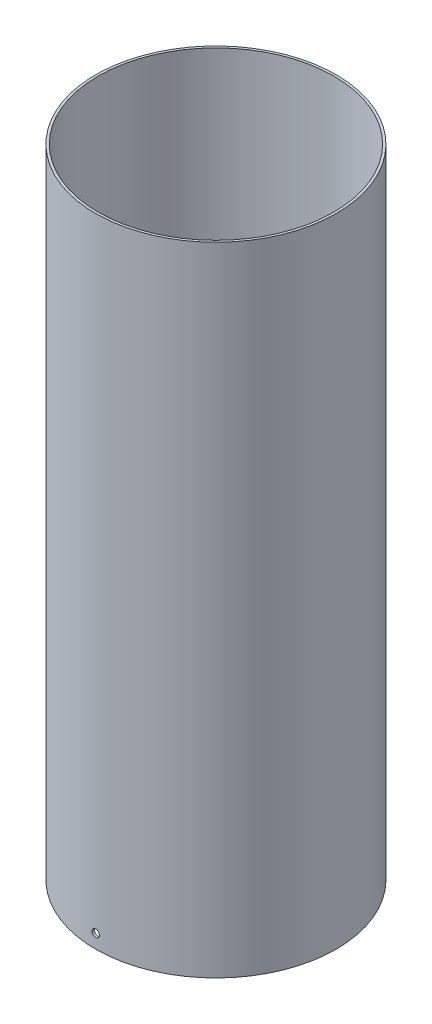
ISO-10303-21;
HEADER;
FILE_DESCRIPTION(('STEP AP214'),'2;1');
FILE_NAME('part.step','',(''),(''),'','','');
FILE_SCHEMA(('AUTOMOTIVE_DESIGN { 1 0 10303 214 1 1 1 1 }'));
ENDSEC;
DATA;
#1=APPLICATION_CONTEXT('core data for automotive mechanical design processes');
#2=APPLICATION_PROTOCOL_DEFINITION('international standard','automotive_design',2000,#1);
#3=PRODUCT_CONTEXT('',#1,'mechanical');
#4=PRODUCT('Part','Part','',(#3));
#5=PRODUCT_RELATED_PRODUCT_CATEGORY('part','',(#4));
#6=PRODUCT_DEFINITION_FORMATION('','',#4);
#7=PRODUCT_DEFINITION_CONTEXT('part definition',#1,'design');
#8=PRODUCT_DEFINITION('design','',#6,#7);
#9=PRODUCT_DEFINITION_SHAPE('','',#8);
#10=(LENGTH_UNIT() NAMED_UNIT(*) SI_UNIT(.MILLI.,.METRE.));
#11=(NAMED_UNIT(*) PLANE_ANGLE_UNIT() SI_UNIT($,.RADIAN.));
#12=(NAMED_UNIT(*) SI_UNIT($,.STERADIAN.) SOLID_ANGLE_UNIT());
#13=UNCERTAINTY_MEASURE_WITH_UNIT(LENGTH_MEASURE(1.E-05),#10,'distance_accuracy_value','');
#14=(GEOMETRIC_REPRESENTATION_CONTEXT(3) GLOBAL_UNCERTAINTY_ASSIGNED_CONTEXT((#13)) GLOBAL_UNIT_ASSIGNED_CONTEXT((#10,
#11,#12)) REPRESENTATION_CONTEXT('',''));
#15=CARTESIAN_POINT('',(0.,0.,0.));
#16=DIRECTION('',(0.,0.,1.));
#17=DIRECTION('',(1.,0.,0.));
#18=AXIS2_PLACEMENT_3D('',#15,#16,#17);
#19=CARTESIAN_POINT('',(0.,274.5994,0.));
#20=DIRECTION('',(0.,-1.,0.));
#21=DIRECTION('',(1.,0.,0.));
#22=AXIS2_PLACEMENT_3D('',#19,#20,#21);
#23=CYLINDRICAL_SURFACE('',#22,50.8);
#24=CARTESIAN_POINT('',(-1.58750000000736,5.9999999993488,50.7751892537165));
#25=CARTESIAN_POINT('',(-1.58749619983418,6.08915423949237,50.7751895769728));
#26=CARTESIAN_POINT('',(-1.57996495608852,6.17836742808937,50.7754265714668));
#27=CARTESIAN_POINT('',(-1.55002846739846,6.35432966807033,50.7763490960113));
#28=CARTESIAN_POINT('',(-1.5276068162731,6.4410758913041,50.7770351207893));
#29=CARTESIAN_POINT('',(-1.46852946898106,6.60953934015379,50.7787779445609));
#30=CARTESIAN_POINT('',(-1.43188000009186,6.69125874782033,50.7798345813244));
#31=CARTESIAN_POINT('',(-1.3453979424793,6.84736148786531,50.7821993055451));
#32=CARTESIAN_POINT('',(-1.2955687598925,6.92174670886636,50.7835073280109));
#33=CARTESIAN_POINT('',(-1.18411997411548,7.06112211765091,50.7862280451666));
#34=CARTESIAN_POINT('',(-1.12249676817486,7.12610942395237,50.7876407717597));
#35=CARTESIAN_POINT('',(-0.989196312172254,7.24483497320207,50.7904117412253));
#36=CARTESIAN_POINT('',(-0.917516432493183,7.29857026478644,50.7917699697277));
#37=CARTESIAN_POINT('',(-0.766110434000233,7.39327400664442,50.7942792721416));
#38=CARTESIAN_POINT('',(-0.686379307549593,7.43423444578459,50.7954302158742));
#39=CARTESIAN_POINT('',(-0.521225009060392,7.50214373864585,50.7973928174328));
#40=CARTESIAN_POINT('',(-0.435808225643811,7.52910802885086,50.7982048488538));
#41=CARTESIAN_POINT('',(-0.291599151763764,7.56159250221319,50.7991954580902));
#42=CARTESIAN_POINT('',(-0.233715229465789,7.57129489440393,50.7994957551111));
#43=CARTESIAN_POINT('',(-0.117229382872481,7.58424988884202,50.7998981302817));
#44=CARTESIAN_POINT('',(-0.0586274588759812,7.58750249377367,50.8000002085138));
#45=CARTESIAN_POINT('',(0.0891542086851404,7.58749619711088,50.7999996722877));
#46=CARTESIAN_POINT('',(0.178367409649784,7.57996495754715,50.7997628004587));
#47=CARTESIAN_POINT('',(0.354329675260059,7.55002846785594,50.7988407030554));
#48=CARTESIAN_POINT('',(0.441075911770976,7.52760681161813,50.7981549829567));
#49=CARTESIAN_POINT('',(0.609539389163999,7.46852944927354,50.7964128220679));
#50=CARTESIAN_POINT('',(0.691258811983765,7.43187997012381,50.7953565434761));
#51=CARTESIAN_POINT('',(0.847361578214158,7.34539788684705,50.7929924306615));
#52=CARTESIAN_POINT('',(0.921746810248613,7.29556868885821,50.7916846614573));
#53=CARTESIAN_POINT('',(1.06112221118426,7.18411988928629,50.7889642361043));
#54=CARTESIAN_POINT('',(1.12610950168618,7.12249668880957,50.7875515480208));
#55=CARTESIAN_POINT('',(1.24483502076573,6.98919625085738,50.7847804232366));
#56=CARTESIAN_POINT('',(1.29857029794908,6.91751638373935,50.7834220008453));
#57=CARTESIAN_POINT('',(1.3932740268342,6.76611039745339,50.7809121629807));
#58=CARTESIAN_POINT('',(1.43423446436701,6.6863792687526,50.7797608776435));
#59=CARTESIAN_POINT('',(1.50214375429553,6.52122496461925,50.7777975953316));
#60=CARTESIAN_POINT('',(1.52910804319443,6.43580817781818,50.7769852247591));
#61=CARTESIAN_POINT('',(1.56159251124268,6.29159910124387,50.7759941790135));
#62=CARTESIAN_POINT('',(1.57129490066621,6.23371518037631,50.7756937415988));
#63=CARTESIAN_POINT('',(1.58424989319525,6.11722933651178,50.7752911727024));
#64=CARTESIAN_POINT('',(1.58750249900364,6.05862741381571,50.7751890411377));
#65=CARTESIAN_POINT('',(1.58749619978513,5.91084575980337,50.7751895769653));
#66=CARTESIAN_POINT('',(1.57996495600656,5.82163257120842,50.7754265714669));
#67=CARTESIAN_POINT('',(1.55002846724337,5.64567033123898,50.7763490960185));
#68=CARTESIAN_POINT('',(1.5276068160773,5.55892410801477,50.777035120796));
#69=CARTESIAN_POINT('',(1.46852946871346,5.39046065920579,50.7787779445678));
#70=CARTESIAN_POINT('',(1.43187999979578,5.30874125156949,50.7798345813319));
#71=CARTESIAN_POINT('',(1.34539794211846,5.15263851155909,50.7821993055555));
#72=CARTESIAN_POINT('',(1.29556875949082,5.07825329056491,50.7835073280237));
#73=CARTESIAN_POINT('',(1.1841199736136,4.93887788178788,50.7862280451759));
#74=CARTESIAN_POINT('',(1.12249676760972,4.8738905754902,50.7876407717632));
#75=CARTESIAN_POINT('',(0.989196311544496,4.7551650262929,50.7904117412467));
#76=CARTESIAN_POINT('',(0.91751643187614,4.70142973474584,50.791769969773));
#77=CARTESIAN_POINT('',(0.766110433447264,4.60672599309153,50.7942792721157));
#78=CARTESIAN_POINT('',(0.686379307053391,4.56576555411235,50.7954302157532));
#79=CARTESIAN_POINT('',(0.521225008552106,4.49785626104426,50.7973928175656));
#80=CARTESIAN_POINT('',(0.435808225055958,4.47089197049777,50.7982048493345));
#81=CARTESIAN_POINT('',(0.291599154631136,4.43840749877386,50.7991954577572));
#82=CARTESIAN_POINT('',(0.233715235969339,4.42870510768408,50.7994957540962));
#83=CARTESIAN_POINT('',(0.117229396946549,4.41575011135852,50.7998981312256));
#84=CARTESIAN_POINT('',(0.0586274768858958,4.41249750342489,50.8000002120988));
#85=CARTESIAN_POINT('',(-0.0891541865474093,4.41250379652251,50.7999996774629));
#86=CARTESIAN_POINT('',(-0.178367387386223,4.42003503856594,50.7997628019142));
#87=CARTESIAN_POINT('',(-0.354329653420859,4.44997152852658,50.7988407018296));
#88=CARTESIAN_POINT('',(-0.441075890474671,4.47239318259382,50.7981549827732));
#89=CARTESIAN_POINT('',(-0.609539368975796,4.53147054196785,50.7964128226802));
#90=CARTESIAN_POINT('',(-0.691258792366649,4.56812002030004,50.795356543843));
#91=CARTESIAN_POINT('',(-0.847361559762023,4.65460210163858,50.7929924308712));
#92=CARTESIAN_POINT('',(-0.921746792404995,4.70443129848034,50.7916846617555));
#93=CARTESIAN_POINT('',(-1.06112219477921,4.81588009598839,50.7889642364746));
#94=CARTESIAN_POINT('',(-1.12610948610553,4.87750329555551,50.7875515483744));
#95=CARTESIAN_POINT('',(-1.24483500703578,5.01080373186848,50.7847804235672));
#96=CARTESIAN_POINT('',(-1.2985702852358,5.08248359826556,50.7834220011696));
#97=CARTESIAN_POINT('',(-1.39327401623888,5.23388958327504,50.7809121632742));
#98=CARTESIAN_POINT('',(-1.4342344548773,5.31362071141776,50.7797608779126));
#99=CARTESIAN_POINT('',(-1.50214374708862,5.47877501461135,50.7777975955453));
#100=CARTESIAN_POINT('',(-1.52910803716675,5.56419180102964,50.7769852249418));
#101=CARTESIAN_POINT('',(-1.56159250798589,5.70840088060602,50.7759941791136));
#102=CARTESIAN_POINT('',(-1.57129489860358,5.76628480488009,50.775693741661));
#103=CARTESIAN_POINT('',(-1.58424989275122,5.882770655693,50.7752911727181));
#104=CARTESIAN_POINT('',(-1.58750249898374,5.94137258193098,50.7751890411446));
#105=CARTESIAN_POINT('',(-1.58750000000736,5.9999999993488,50.7751892537165));
#106=B_SPLINE_CURVE_WITH_KNOTS('',3,(#24,#25,#26,#27,#28,#29,#30,#31,#32,#33,#34,#35,#36,#37,
#38,#39,#40,#41,#42,#43,#44,#45,#46,#47,#48,#49,#50,#51,#52,#53,#54,#55,#56,#57,#58,#59,#60,#61,
#62,#63,#64,#65,#66,#67,#68,#69,#70,#71,#72,#73,#74,#75,#76,#77,#78,#79,#80,#81,#82,#83,#84,#85,
#86,#87,#88,#89,#90,#91,#92,#93,#94,#95,#96,#97,#98,#99,#100,#101,#102,#103,#104,#105),
.UNSPECIFIED.,.T.,.F.,(4,2,2,2,2,2,2,2,2,2,2,2,2,2,2,2,2,2,2,2,2,2,2,2,2,2,2,2,2,2,2,2,2,2,2,2,
2,2,2,2,4),(0.,0.267249355834809,0.534793655357869,0.802220987005577,1.06957927273074,
1.3370193598039,1.60452950784296,1.87220707623947,2.13958878986001,2.31533080099196,
2.49107273898265,2.75832213094901,3.02586646518689,3.29329383758803,3.56065216404982,
3.82809220430804,4.09560230624948,4.36327989199762,4.63066162257453,4.80640363028557,
4.9821455643496,5.24939492017897,5.51693921970551,5.78436655130744,6.05172483707863,
6.31916492428621,6.58667507219117,6.85435264033993,7.12173435420816,7.29747635435722,
7.47321828099604,7.74046767272806,8.00801200753887,8.27543938019465,8.54279770637471,
8.81023774651323,9.07774784856487,9.3454254343345,9.61280716489187,9.78854918320958,
9.96429112788813),.UNSPECIFIED.);
#107=CARTESIAN_POINT('',(-1.58750000000736,5.9999999993488,50.7751892537165));
#108=VERTEX_POINT('',#107);
#109=EDGE_CURVE('E51',#108,#108,#106,.T.);
#110=ORIENTED_EDGE('',*,*,#109,.F.);
#111=EDGE_LOOP('',(#110));
#112=FACE_BOUND('',#111,.T.);
#113=CARTESIAN_POINT('',(-1.50032763990282E-13,0.,0.));
#114=DIRECTION('',(0.,-1.,0.));
#115=DIRECTION('',(1.,0.,0.));
#116=AXIS2_PLACEMENT_3D('',#113,#114,#115);
#117=CIRCLE('',#116,50.8);
#118=CARTESIAN_POINT('',(50.7999999999998,0.,0.));
#119=VERTEX_POINT('',#118);
#120=EDGE_CURVE('E57',#119,#119,#117,.T.);
#121=ORIENTED_EDGE('',*,*,#120,.T.);
#122=EDGE_LOOP('',(#121));
#123=FACE_BOUND('',#122,.T.);
#124=CARTESIAN_POINT('',(-1.58750000000737,5.9999999993488,-50.7751892537165));
#125=CARTESIAN_POINT('',(-1.58749619975965,5.91084575926207,-50.7751895769752));
#126=CARTESIAN_POINT('',(-1.57996495594711,5.82163257068361,-50.7754265714712));
#127=CARTESIAN_POINT('',(-1.55002846712371,5.64567033071139,-50.7763490960198));
#128=CARTESIAN_POINT('',(-1.52760681592154,5.55892410746966,-50.7770351208001));
#129=CARTESIAN_POINT('',(-1.46852946848369,5.39046065865145,-50.7787779445751));
#130=CARTESIAN_POINT('',(-1.43187999953187,5.30874125102212,-50.7798345813396));
#131=CARTESIAN_POINT('',(-1.34539794179392,5.1526385110443,-50.782199305564));
#132=CARTESIAN_POINT('',(-1.29556875914167,5.07825329007468,-50.7835073280326));
#133=CARTESIAN_POINT('',(-1.18411997321595,4.93887788134419,-50.7862280451852));
#134=CARTESIAN_POINT('',(-1.12249676718731,4.8738905750692,-50.7876407717725));
#135=CARTESIAN_POINT('',(-0.989196311077617,4.75516502592185,-50.7904117412558));
#136=CARTESIAN_POINT('',(-0.917516431389657,4.70142973440193,-50.7917699697818));
#137=CARTESIAN_POINT('',(-0.766110432930949,4.60672599280823,-50.7942792721235));
#138=CARTESIAN_POINT('',(-0.686379306527461,4.56576555386153,-50.7954302157603));
#139=CARTESIAN_POINT('',(-0.521225008004413,4.49785626085355,-50.7973928175713));
#140=CARTESIAN_POINT('',(-0.435808224495178,4.47089197033693,-50.7982048493394));
#141=CARTESIAN_POINT('',(-0.291599149551019,4.43840749765224,-50.7991954577914));
#142=CARTESIAN_POINT('',(-0.233715226278199,4.42870510607076,-50.7994957541461));
#143=CARTESIAN_POINT('',(-0.11722937797888,4.41575010978453,-50.7998981312747));
#144=CARTESIAN_POINT('',(-0.0586274532527203,4.41249750238193,-50.8000002121314));
#145=CARTESIAN_POINT('',(0.089154214802322,4.41250379810824,-50.7999996774134));
#146=CARTESIAN_POINT('',(0.178367415512186,4.42003504174046,-50.799762801815));
#147=CARTESIAN_POINT('',(0.354329681013868,4.44997153483494,-50.7988407016367));
#148=CARTESIAN_POINT('',(0.441075917663805,4.47239319044478,-50.7981549825362));
#149=CARTESIAN_POINT('',(0.609539395108812,4.53147055281465,-50.7964128223658));
#150=CARTESIAN_POINT('',(0.691258817847204,4.56812003260105,-50.7953565434951));
#151=CARTESIAN_POINT('',(0.847361583705728,4.65460211671877,-50.7929924304706));
#152=CARTESIAN_POINT('',(0.921746815464165,4.7044313148859,-50.7916846613357));
#153=CARTESIAN_POINT('',(1.06112221585711,4.81588011487679,-50.7889642360329));
#154=CARTESIAN_POINT('',(1.12610950608687,4.877503315601,-50.78755154793));
#155=CARTESIAN_POINT('',(1.24483502464704,5.01080375403082,-50.7847804231341));
#156=CARTESIAN_POINT('',(1.29857030157311,5.08248362138792,-50.7834220007505));
#157=CARTESIAN_POINT('',(1.39327402988602,5.23388960809292,-50.7809121628986));
#158=CARTESIAN_POINT('',(1.43423446710757,5.31362073697135,-50.7797608775664));
#159=CARTESIAN_POINT('',(1.50214375637539,5.47877504137801,-50.7777975952694));
#160=CARTESIAN_POINT('',(1.52910804492941,5.56419182827292,-50.7769852247066));
#161=CARTESIAN_POINT('',(1.56159251216356,5.70840090390511,-50.7759941789852));
#162=CARTESIAN_POINT('',(1.57129490123655,5.76628482372939,-50.7756937415811));
#163=CARTESIAN_POINT('',(1.58424989330224,5.88277066547267,-50.775291172699));
#164=CARTESIAN_POINT('',(1.58750249899732,5.94137258709081,-50.7751890411379));
#165=CARTESIAN_POINT('',(1.58749619979467,6.08915424002381,-50.775189576965));
#166=CARTESIAN_POINT('',(1.57996495602585,6.17836742861993,-50.7754265714663));
#167=CARTESIAN_POINT('',(1.55002846728184,6.35432966859327,-50.7763490960173));
#168=CARTESIAN_POINT('',(1.52760681612502,6.44107589182018,-50.7770351207946));
#169=CARTESIAN_POINT('',(1.46852946877958,6.6095393406346,-50.7787779445659));
#170=CARTESIAN_POINT('',(1.43187999987134,6.69125874827374,-50.7798345813298));
#171=CARTESIAN_POINT('',(1.34539794221131,6.84736148829369,-50.7821993055531));
#172=CARTESIAN_POINT('',(1.29556875959116,6.92174670929437,-50.7835073280212));
#173=CARTESIAN_POINT('',(1.18411997372291,7.06112211809068,-50.7862280451733));
#174=CARTESIAN_POINT('',(1.12249676771965,7.12610942440046,-50.7876407717607));
#175=CARTESIAN_POINT('',(0.98919631166641,7.24483497360995,-50.7904117412443));
#176=CARTESIAN_POINT('',(0.917516432011214,7.29857026515914,-50.7917699697705));
#177=CARTESIAN_POINT('',(0.766110433626429,7.39327400680695,-50.7942792721129));
#178=CARTESIAN_POINT('',(0.686379307266005,7.43423444578155,-50.7954302157501));
#179=CARTESIAN_POINT('',(0.521225008790383,7.5021437388764,-50.7973928175633));
#180=CARTESIAN_POINT('',(0.435808225281747,7.52910802944294,-50.7982048493328));
#181=CARTESIAN_POINT('',(0.291599132504094,7.56159250621602,-50.7991954579093));
#182=CARTESIAN_POINT('',(0.233715190990537,7.57129489985845,-50.7994957543295));
#183=CARTESIAN_POINT('',(0.117229305981073,7.58424989621803,-50.7998981314619));
#184=CARTESIAN_POINT('',(0.0586273627855031,7.58750250163302,-50.8000002122569));
#185=CARTESIAN_POINT('',(-0.0891543237379503,7.58749619578744,-50.7999996772227));
#186=CARTESIAN_POINT('',(-0.178367524118303,7.57996494601087,-50.7997628014323));
#187=CARTESIAN_POINT('',(-0.354329787886861,7.5500284407411,-50.7988407008896));
#188=CARTESIAN_POINT('',(-0.44107602313371,7.52760677911,-50.7981549816172));
#189=CARTESIAN_POINT('',(-0.609539496635359,7.46852940504587,-50.7964128211442));
#190=CARTESIAN_POINT('',(-0.691258916841699,7.43187991960852,-50.7953565421433));
#191=CARTESIAN_POINT('',(-0.847361676734807,7.34539782469001,-50.7929924289141));
#192=CARTESIAN_POINT('',(-0.921746905059299,7.29556862137142,-50.7916846597045));
#193=CARTESIAN_POINT('',(-1.06112229775688,7.18411981173094,-50.7889642343165));
#194=CARTESIAN_POINT('',(-1.12610958372623,7.12249660651034,-50.7875515462031));
#195=CARTESIAN_POINT('',(-1.24483509307731,6.98919615985529,-50.7847804214514));
#196=CARTESIAN_POINT('',(-1.29857036505323,6.91751628876839,-50.7834219991225));
#197=CARTESIAN_POINT('',(-1.39327408291156,6.76611029547723,-50.7809121614388));
#198=CARTESIAN_POINT('',(-1.43423451462636,6.68637916374174,-50.7797608762203));
#199=CARTESIAN_POINT('',(-1.5021437924597,6.5212248546218,-50.7777975941983));
#200=CARTESIAN_POINT('',(-1.52910807509538,6.43580806587331,-50.7769852237967));
#201=CARTESIAN_POINT('',(-1.56159252834562,6.29159900577732,-50.7759941784849));
#202=CARTESIAN_POINT('',(-1.57129491138661,6.23371510346045,-50.7756937412648));
#203=CARTESIAN_POINT('',(-1.58424989537849,6.11722929740362,-50.7752911726354));
#204=CARTESIAN_POINT('',(-1.58750249903178,6.05862739396451,-50.7751890411431));
#205=CARTESIAN_POINT('',(-1.58750000000737,5.9999999993488,-50.7751892537165));
#206=B_SPLINE_CURVE_WITH_KNOTS('',3,(#124,#125,#126,#127,#128,#129,#130,#131,#132,#133,#134,
#135,#136,#137,#138,#139,#140,#141,#142,#143,#144,#145,#146,#147,#148,#149,#150,#151,#152,#153,
#154,#155,#156,#157,#158,#159,#160,#161,#162,#163,#164,#165,#166,#167,#168,#169,#170,#171,#172,
#173,#174,#175,#176,#177,#178,#179,#180,#181,#182,#183,#184,#185,#186,#187,#188,#189,#190,#191,
#192,#193,#194,#195,#196,#197,#198,#199,#200,#201,#202,#203,#204,#205),.UNSPECIFIED.,.T.,.F.,(4,
2,2,2,2,2,2,2,2,2,2,2,2,2,2,2,2,2,2,2,2,2,2,2,2,2,2,2,2,2,2,2,2,2,2,2,2,2,2,2,4),(0.,
0.267249355741889,0.53479365535834,0.802220986979308,1.06957927273167,1.33701935994053,
1.60452950784446,1.87220707597175,2.13958878986139,2.31533080381229,2.49107274425288,
2.75832213601166,3.02586647080594,3.29329384346291,3.56065216965176,3.82809220979201,
4.09560231185415,4.36327989764581,4.63066162817864,4.80640363264869,4.98214556348496,
5.24939491931273,5.51693921884082,5.78436655043879,6.05172483621388,6.31916492344525,
6.58667507132633,6.85435263936681,7.12173435334334,7.29747642194996,7.47321841704694,
7.74046780940831,8.00801214463405,8.27543951730519,8.54279784353802,8.81023788368662,
9.07774798578794,9.34542557166026,9.61280730210264,9.78854925211459,9.96429112849236),.UNSPECIFIED.);
#207=CARTESIAN_POINT('',(-1.58750000000737,5.9999999993488,-50.7751892537165));
#208=VERTEX_POINT('',#207);
#209=EDGE_CURVE('E19',#208,#208,#206,.T.);
#210=ORIENTED_EDGE('',*,*,#209,.F.);
#211=EDGE_LOOP('',(#210));
#212=FACE_BOUND('',#211,.T.);
#213=CARTESIAN_POINT('',(0.,274.5994,0.));
#214=DIRECTION('',(0.,-1.,0.));
#215=DIRECTION('',(1.,0.,0.));
#216=AXIS2_PLACEMENT_3D('',#213,#214,#215);
#217=CIRCLE('',#216,50.8);
#218=CARTESIAN_POINT('',(50.8,274.5994,0.));
#219=VERTEX_POINT('',#218);
#220=EDGE_CURVE('E56',#219,#219,#217,.T.);
#221=ORIENTED_EDGE('',*,*,#220,.F.);
#222=EDGE_LOOP('',(#221));
#223=FACE_BOUND('',#222,.T.);
#224=ADVANCED_FACE('F15',(#112,#123,#212,#223),#23,.F.);
#225=CARTESIAN_POINT('',(0.,6.,-51.822244864));
#226=DIRECTION('',(0.,0.,1.));
#227=DIRECTION('',(1.,0.,0.));
#228=AXIS2_PLACEMENT_3D('',#225,#226,#227);
#229=CYLINDRICAL_SURFACE('',#228,1.5875);
#230=ORIENTED_EDGE('',*,*,#209,.T.);
#231=EDGE_LOOP('',(#230));
#232=FACE_BOUND('',#231,.T.);
#233=CARTESIAN_POINT('',(-3.72220064293379E-09,7.5875,-51.816));
#234=CARTESIAN_POINT('',(0.0891551782581725,7.58749620008024,-51.8159996836583));
#235=CARTESIAN_POINT('',(0.178369313905864,7.57996479941125,-51.8157674477554));
#236=CARTESIAN_POINT('',(0.354333466354749,7.55002765668721,-51.8148634091305));
#237=CARTESIAN_POINT('',(0.441080654819777,7.52760550693086,-51.8141911215396));
#238=CARTESIAN_POINT('',(0.609546049797611,7.4685267551573,-51.8124830870241));
#239=CARTESIAN_POINT('',(0.691266435247595,7.43187637165624,-51.8114474989007));
#240=CARTESIAN_POINT('',(0.847370940986165,7.34539207493136,-51.8091296999394));
#241=CARTESIAN_POINT('',(0.921756950884776,7.29556156964863,-51.8078475528768));
#242=CARTESIAN_POINT('',(1.06113273043937,7.18411048777763,-51.8051804528585));
#243=CARTESIAN_POINT('',(1.12611973327885,7.1224864518415,-51.8037954698115));
#244=CARTESIAN_POINT('',(1.24484446895297,6.98918439176055,-51.8010787049087));
#245=CARTESIAN_POINT('',(1.29857925052741,6.91750373815349,-51.7997469370842));
#246=CARTESIAN_POINT('',(1.39328138687857,6.76609696149971,-51.7972863713983));
#247=CARTESIAN_POINT('',(1.43424082917012,6.68636589267993,-51.7961576995079));
#248=CARTESIAN_POINT('',(1.50214820298013,6.52121204656739,-51.7942329913601));
#249=CARTESIAN_POINT('',(1.52911157049193,6.43579565735142,-51.7934365888406));
#250=CARTESIAN_POINT('',(1.56159432598547,6.29158897801707,-51.7924650424226));
#251=CARTESIAN_POINT('',(1.57129603907809,6.23370701341546,-51.7921705217667));
#252=CARTESIAN_POINT('',(1.58425012487515,6.11722518396742,-51.791775881225));
#253=CARTESIAN_POINT('',(1.58750250017634,6.05862531941004,-51.7916757612609));
#254=CARTESIAN_POINT('',(1.58749619782863,5.91084479296812,-51.7916762866764));
#255=CARTESIAN_POINT('',(1.57996479673531,5.82163066861097,-51.7919086346379));
#256=CARTESIAN_POINT('',(1.55002765746168,5.64566653995584,-51.7928130731773));
#257=CARTESIAN_POINT('',(1.52760551154002,5.55891936400337,-51.7934856488194));
#258=CARTESIAN_POINT('',(1.46852677310208,5.39045399569751,-51.7951943086792));
#259=CARTESIAN_POINT('',(1.43187639937858,5.30873362430922,-51.796230234067));
#260=CARTESIAN_POINT('',(1.34539212658033,5.1526291427237,-51.7985486089936));
#261=CARTESIAN_POINT('',(1.29556163541858,5.07824314293236,-51.7998309947831));
#262=CARTESIAN_POINT('',(1.18411056614369,4.93886735599022,-51.8024983698014));
#263=CARTESIAN_POINT('',(1.12248652512174,4.87388033850236,-51.8038833890929));
#264=CARTESIAN_POINT('',(0.989184448368385,4.75515557494908,-51.8066000075984));
#265=CARTESIAN_POINT('',(0.917503783215921,4.70142078009595,-51.8079315927241));
#266=CARTESIAN_POINT('',(0.766096995433641,4.60671863190633,-51.8103916537713));
#267=CARTESIAN_POINT('',(0.686365928784055,4.5657591882481,-51.8115200036808));
#268=CARTESIAN_POINT('',(0.52121208791523,4.49785181145349,-51.8134440705994));
#269=CARTESIAN_POINT('',(0.43579570175158,4.47088844237195,-51.814240153867));
#270=CARTESIAN_POINT('',(0.291589023392858,4.43840568235039,-51.8152112882442));
#271=CARTESIAN_POINT('',(0.233707056018833,4.42870396715411,-51.8155056759911));
#272=CARTESIAN_POINT('',(0.11722522136468,4.41574987778962,-51.8159001358419));
#273=CARTESIAN_POINT('',(0.058625354373149,4.41249750102886,-51.8160002080238));
#274=CARTESIAN_POINT('',(-0.0891551856575787,4.41250380033886,-51.8159996836454));
#275=CARTESIAN_POINT('',(-0.178369321257508,4.42003520142102,-51.8157674477299));
#276=CARTESIAN_POINT('',(-0.354333473578334,4.44997234496112,-51.8148634090811));
#277=CARTESIAN_POINT('',(-0.441080661961448,4.47239449512921,-51.8141911214786));
#278=CARTESIAN_POINT('',(-0.609546056691819,4.53147324770447,-51.8124830869427));
#279=CARTESIAN_POINT('',(-0.691266441977373,4.5681236315924,-51.8114474988106));
#280=CARTESIAN_POINT('',(-0.847370947310361,4.65460792905205,-51.8091296998356));
#281=CARTESIAN_POINT('',(-0.921756956968987,4.7044384346806,-51.8078475527682));
#282=CARTESIAN_POINT('',(-1.06113273598955,4.81588951719668,-51.8051804527445));
#283=CARTESIAN_POINT('',(-1.12611973853504,4.87751355343196,-51.8037954696969));
#284=CARTESIAN_POINT('',(-1.24484447358641,5.01081561406996,-51.801078704797));
#285=CARTESIAN_POINT('',(-1.29857925483013,5.08249626793665,-51.799746936976));
#286=CARTESIAN_POINT('',(-1.39328139049055,5.23390304506474,-51.7972863713008));
#287=CARTESIAN_POINT('',(-1.4342408324189,5.31363411410115,-51.7961576994176));
#288=CARTESIAN_POINT('',(-1.50214820544613,5.47878796054777,-51.7942329912883));
#289=CARTESIAN_POINT('',(-1.52911157254788,5.56420434987732,-51.7934365887798));
#290=CARTESIAN_POINT('',(-1.56159432316025,5.7084110106907,-51.7924650425067));
#291=CARTESIAN_POINT('',(-1.57129603385435,5.76629295624991,-51.7921705219252));
#292=CARTESIAN_POINT('',(-1.58425011908673,5.88277474734702,-51.791775881402));
#293=CARTESIAN_POINT('',(-1.58750249622176,5.94137459259586,-51.7916757613821));
#294=CARTESIAN_POINT('',(-1.58749620384136,6.08915509982709,-51.7916762864922));
#295=CARTESIAN_POINT('',(-1.57996480878373,6.17836922460814,-51.7919086342686));
#296=CARTESIAN_POINT('',(-1.55002768143663,6.35433335516316,-51.7928130724581));
#297=CARTESIAN_POINT('',(-1.52760554139563,6.44108053259098,-51.7934856479356));
#298=CARTESIAN_POINT('',(-1.46852681437741,6.60954590485992,-51.7951943075057));
#299=CARTESIAN_POINT('',(-1.43187644618661,6.69126627873323,-51.7962302327686));
#300=CARTESIAN_POINT('',(-1.34539218396196,6.84737076616959,-51.7985486074988));
#301=CARTESIAN_POINT('',(-1.29556169784287,6.92175676932741,-51.7998309932168));
#302=CARTESIAN_POINT('',(-1.18411063801505,7.06113256380862,-51.8024983681535));
#303=CARTESIAN_POINT('',(-1.12248660139635,7.12611958546851,-51.803883387435));
#304=CARTESIAN_POINT('',(-0.989184532697163,7.24484435804053,-51.8066000059831));
#305=CARTESIAN_POINT('',(-0.917503871196446,7.29857915774171,-51.8079315911613));
#306=CARTESIAN_POINT('',(-0.766097089861706,7.39328131617014,-51.8103916523703));
#307=CARTESIAN_POINT('',(-0.686366026008514,7.43424076522128,-51.8115200023891));
#308=CARTESIAN_POINT('',(-0.521212189754169,7.5021481532131,-51.8134440695714));
#309=CARTESIAN_POINT('',(-0.435795805406226,7.52911152809027,-51.8142401529931));
#310=CARTESIAN_POINT('',(-0.291589112924982,7.56159430155817,-51.8152112877574));
#311=CARTESIAN_POINT('',(-0.233707129522606,7.57129602253562,-51.815505675678));
#312=CARTESIAN_POINT('',(-0.117225262168323,7.58425011980838,-51.8159001357679));
#313=CARTESIAN_POINT('',(-0.0586253785050126,7.58750249869626,-51.8160002080154));
#314=CARTESIAN_POINT('',(-3.72220064293379E-09,7.5875,-51.816));
#315=B_SPLINE_CURVE_WITH_KNOTS('',3,(#233,#234,#235,#236,#237,#238,#239,#240,#241,#242,#243,
#244,#245,#246,#247,#248,#249,#250,#251,#252,#253,#254,#255,#256,#257,#258,#259,#260,#261,#262,
#263,#264,#265,#266,#267,#268,#269,#270,#271,#272,#273,#274,#275,#276,#277,#278,#279,#280,#281,
#282,#283,#284,#285,#286,#287,#288,#289,#290,#291,#292,#293,#294,#295,#296,#297,#298,#299,#300,
#301,#302,#303,#304,#305,#306,#307,#308,#309,#310,#311,#312,#313,#314),.UNSPECIFIED.,.T.,.F.,(4,
2,2,2,2,2,2,2,2,2,2,2,2,2,2,2,2,2,2,2,2,2,2,2,2,2,2,2,2,2,2,2,2,2,2,2,2,2,2,2,4),(0.,
0.267252191375365,0.534799350165908,0.802229707623686,1.06959098396936,1.33703080483363,
1.60454068285461,1.87221591726526,2.13959530734945,2.31533115030991,2.49106692251245,
2.75831908043573,3.02586620654261,3.29329652609223,3.560657765086,3.82809762943528,
4.09560754980809,4.36328276789923,4.63066214260319,4.80639799300129,4.98213377275578,
5.24938596405301,5.51693312292428,5.78436348040434,6.05172475673027,6.319164577573,
6.58667445561861,6.85434969011978,7.12172908011281,7.29746486589355,7.47320058091615,
7.74045273853975,8.00799986452672,8.27543018407867,8.5427914230418,8.81023128738256,
9.07774120771914,9.34541642573602,9.61279580052349,9.78853170090692,9.96426753064654),.UNSPECIFIED.);
#316=CARTESIAN_POINT('',(-3.72220064293379E-09,7.5875,-51.816));
#317=VERTEX_POINT('',#316);
#318=EDGE_CURVE('E80',#317,#317,#315,.T.);
#319=ORIENTED_EDGE('',*,*,#318,.T.);
#320=EDGE_LOOP('',(#319));
#321=FACE_BOUND('',#320,.T.);
#322=ADVANCED_FACE('F47',(#232,#321),#229,.F.);
#323=CARTESIAN_POINT('',(-52.437792,0.,-52.437792));
#324=DIRECTION('',(0.,1.,0.));
#325=DIRECTION('',(0.,0.,1.));
#326=AXIS2_PLACEMENT_3D('',#323,#324,#325);
#327=PLANE('',#326);
#328=ORIENTED_EDGE('',*,*,#120,.F.);
#329=EDGE_LOOP('',(#328));
#330=FACE_BOUND('',#329,.T.);
#331=CARTESIAN_POINT('',(-1.47090945088512E-13,0.,0.));
#332=DIRECTION('',(0.,-1.,0.));
#333=DIRECTION('',(1.,0.,0.));
#334=AXIS2_PLACEMENT_3D('',#331,#332,#333);
#335=CIRCLE('',#334,51.816);
#336=CARTESIAN_POINT('',(51.8159999999998,0.,0.));
#337=VERTEX_POINT('',#336);
#338=EDGE_CURVE('E32',#337,#337,#335,.T.);
#339=ORIENTED_EDGE('',*,*,#338,.T.);
#340=EDGE_LOOP('',(#339));
#341=FACE_BOUND('',#340,.T.);
#342=ADVANCED_FACE('F45',(#330,#341),#327,.F.);
#343=CARTESIAN_POINT('',(0.,6.,50.768944389));
#344=DIRECTION('',(0.,0.,1.));
#345=DIRECTION('',(1.,0.,0.));
#346=AXIS2_PLACEMENT_3D('',#343,#344,#345);
#347=CYLINDRICAL_SURFACE('',#346,1.5875);
#348=ORIENTED_EDGE('',*,*,#109,.T.);
#349=EDGE_LOOP('',(#348));
#350=FACE_BOUND('',#349,.T.);
#351=CARTESIAN_POINT('',(-2.12552766013304E-08,4.4125,51.816));
#352=CARTESIAN_POINT('',(0.0891551606512781,4.41250379893672,51.8159996836884));
#353=CARTESIAN_POINT('',(0.17836929636071,4.42003519861178,51.8157674478159));
#354=CARTESIAN_POINT('',(0.354333449157224,4.44997233937679,51.8148634092485));
#355=CARTESIAN_POINT('',(0.441080637905854,4.47239448818225,51.8141911216842));
#356=CARTESIAN_POINT('',(0.60954603358017,4.53147323811172,51.8124830872154));
#357=CARTESIAN_POINT('',(0.69126641944478,4.56812362071437,51.8114474991122));
#358=CARTESIAN_POINT('',(0.847370926137073,4.65460791571654,51.809129700183));
#359=CARTESIAN_POINT('',(0.921756936576372,4.704438420172,51.8078475531322));
#360=CARTESIAN_POINT('',(1.06113271734909,4.81588950049216,51.8051804531275));
#361=CARTESIAN_POINT('',(1.12611972086554,4.87751353570539,51.8037954700822));
#362=CARTESIAN_POINT('',(1.24484445801275,5.01081559447143,51.8010787051724));
#363=CARTESIAN_POINT('',(1.29857924038209,5.08249624748764,51.7997469373393));
#364=CARTESIAN_POINT('',(1.39328137841659,5.23390302310849,51.7972863716267));
#365=CARTESIAN_POINT('',(1.43424082159499,5.3136340914873,51.7961576997182));
#366=CARTESIAN_POINT('',(1.50214819722723,5.47878793685648,51.7942329915275));
#367=CARTESIAN_POINT('',(1.52911156567894,5.56420432576798,51.7934365889831));
#368=CARTESIAN_POINT('',(1.56159432075055,5.70841099578814,51.7924650425801));
#369=CARTESIAN_POINT('',(1.57129603346315,5.76629295112873,51.7921705219371));
#370=CARTESIAN_POINT('',(1.58425012053944,5.8827747620132,51.7917758813577));
#371=CARTESIAN_POINT('',(1.58750249749984,5.94137461726801,51.7916757613429));
#372=CARTESIAN_POINT('',(1.58749620189834,6.0891551346726,51.7916762865517));
#373=CARTESIAN_POINT('',(1.57996480485696,6.17836925950868,51.7919086343889));
#374=CARTESIAN_POINT('',(1.55002767352702,6.35433338980949,51.7928130726954));
#375=CARTESIAN_POINT('',(1.52760553149211,6.44108056692861,51.7934856482288));
#376=CARTESIAN_POINT('',(1.46852680060403,6.6095459380431,51.7951943078973));
#377=CARTESIAN_POINT('',(1.43187643056935,6.69126631108205,51.7962302332018));
#378=CARTESIAN_POINT('',(1.34539216482143,6.84737079655923,51.7985486079974));
#379=CARTESIAN_POINT('',(1.295561677022,6.92175679859181,51.7998309937392));
#380=CARTESIAN_POINT('',(1.18411061404435,7.06113259055763,51.8024983687031));
#381=CARTESIAN_POINT('',(1.12248657595595,7.12611961082709,51.803883387988));
#382=CARTESIAN_POINT('',(0.989184504570445,7.24484438039087,51.8066000065218));
#383=CARTESIAN_POINT('',(0.917503841853168,7.29857917847416,51.8079315916825));
#384=CARTESIAN_POINT('',(0.766097058373833,7.393281333484,51.8103916528375));
#385=CARTESIAN_POINT('',(0.686365993592809,7.43424078073439,51.8115200028197));
#386=CARTESIAN_POINT('',(0.521212155802502,7.50214816499331,51.8134440699141));
#387=CARTESIAN_POINT('',(0.435795770846448,7.52911153793937,51.8142401532845));
#388=CARTESIAN_POINT('',(0.291589079407718,7.56159430774851,51.8152112879444));
#389=CARTESIAN_POINT('',(0.233707097602063,7.5712960272156,51.8155056758201));
#390=CARTESIAN_POINT('',(0.117225233609513,7.58425012185439,51.8159001358307));
#391=CARTESIAN_POINT('',(0.0586253517112158,7.58750249961866,51.8160002080436));
#392=CARTESIAN_POINT('',(-0.0891552032321206,7.58749619867738,51.8159996836154));
#393=CARTESIAN_POINT('',(-0.178369338761276,7.57996479660502,51.8157674476694));
#394=CARTESIAN_POINT('',(-0.354333490742782,7.55002765111255,51.8148634089633));
#395=CARTESIAN_POINT('',(-0.441080678858542,7.52760549999019,51.8141911213342));
#396=CARTESIAN_POINT('',(-0.609546072911581,7.46852674556334,51.8124830867514));
#397=CARTESIAN_POINT('',(-0.691266457786267,7.43187636077534,51.8114474985989));
#398=CARTESIAN_POINT('',(-0.847370962165463,7.34539206159203,51.809129699592));
#399=CARTESIAN_POINT('',(-0.921756971280139,7.29556155513795,51.8078475525128));
#400=CARTESIAN_POINT('',(-1.06113274908231,7.18411047107101,51.8051804524755));
#401=CARTESIAN_POINT('',(-1.12611975095312,7.12248643411016,51.8037954694261));
#402=CARTESIAN_POINT('',(-1.24484448453055,6.98918437215702,51.8010787045331));
#403=CARTESIAN_POINT('',(-1.29857926497703,6.91750371770261,51.7997469367209));
#404=CARTESIAN_POINT('',(-1.39328139894309,6.76609693955788,51.7972863710727));
#405=CARTESIAN_POINT('',(-1.43424083997801,6.68636587009497,51.7961576992077));
#406=CARTESIAN_POINT('',(-1.50214821118748,6.52121202291423,51.7942329911212));
#407=CARTESIAN_POINT('',(-1.52911157735472,6.43579563327262,51.7934365886375));
#408=CARTESIAN_POINT('',(-1.56159433092703,6.29158895187223,51.7924650422735));
#409=CARTESIAN_POINT('',(-1.57129604328509,6.23370698552872,51.7921705216389));
#410=CARTESIAN_POINT('',(-1.58425012724914,6.11722515267867,51.7917758811522));
#411=CARTESIAN_POINT('',(-1.58750250145184,6.05862528646119,51.7916757612218));
#412=CARTESIAN_POINT('',(-1.58749619588898,5.91084475821256,51.7916762867358));
#413=CARTESIAN_POINT('',(-1.57996479281811,5.82163063380448,51.791908634758));
#414=CARTESIAN_POINT('',(-1.55002764957265,5.64566650539262,51.792813073414));
#415=CARTESIAN_POINT('',(-1.52760550165749,5.5589193297346,51.793485649112));
#416=CARTESIAN_POINT('',(-1.46852675934954,5.39045396256478,51.7951943090702));
#417=CARTESIAN_POINT('',(-1.43187638378348,5.30873359200603,51.7962302344996));
#418=CARTESIAN_POINT('',(-1.34539210746663,5.15262911237685,51.7985486094916));
#419=CARTESIAN_POINT('',(-1.29556161462892,5.07824311371216,51.7998309953048));
#420=CARTESIAN_POINT('',(-1.18411054221366,4.93886732928689,51.8024983703501));
#421=CARTESIAN_POINT('',(-1.1224864997271,4.87388031318954,51.8038833896449));
#422=CARTESIAN_POINT('',(-0.989184420292168,4.75515555263873,51.8066000081362));
#423=CARTESIAN_POINT('',(-0.917503753922016,4.70142075939849,51.8079315932444));
#424=CARTESIAN_POINT('',(-0.766096963985747,4.60671861461335,51.8103916542379));
#425=CARTESIAN_POINT('',(-0.686365896399186,4.56575917274817,51.8115200041111));
#426=CARTESIAN_POINT('',(-0.521212053990185,4.49785179968374,51.8134440709419));
#427=CARTESIAN_POINT('',(-0.435795667225073,4.47088843253417,51.814240154158));
#428=CARTESIAN_POINT('',(-0.291588998045176,4.43840567799774,51.8152112883763));
#429=CARTESIAN_POINT('',(-0.233707040583924,4.42870396523627,51.8155056760495));
#430=CARTESIAN_POINT('',(-0.117225226026088,4.41574987850932,51.81590013582));
#431=CARTESIAN_POINT('',(-0.0586253692180996,4.41249750195129,51.8160002079955));
#432=CARTESIAN_POINT('',(-2.12552766013304E-08,4.4125,51.816));
#433=B_SPLINE_CURVE_WITH_KNOTS('',3,(#351,#352,#353,#354,#355,#356,#357,#358,#359,#360,#361,
#362,#363,#364,#365,#366,#367,#368,#369,#370,#371,#372,#373,#374,#375,#376,#377,#378,#379,#380,
#381,#382,#383,#384,#385,#386,#387,#388,#389,#390,#391,#392,#393,#394,#395,#396,#397,#398,#399,
#400,#401,#402,#403,#404,#405,#406,#407,#408,#409,#410,#411,#412,#413,#414,#415,#416,#417,#418,
#419,#420,#421,#422,#423,#424,#425,#426,#427,#428,#429,#430,#431,#432),.UNSPECIFIED.,.T.,.F.,(4,
2,2,2,2,2,2,2,2,2,2,2,2,2,2,2,2,2,2,2,2,2,2,2,2,2,2,2,2,2,2,2,2,2,2,2,2,2,2,2,4),(0.,
0.267252191245076,0.5347993501598,0.802229707644336,1.06959098395729,1.33703080480328,
1.60454068283524,1.87221591729069,2.13959530733159,2.31533112287141,2.49106686765399,
2.75831902595704,3.02586615253072,3.29329647206621,3.56065771103087,3.82809757537887,
4.09560749572313,4.36328271374693,4.6306620885244,4.80639798346737,4.98213380776656,
5.2493859991377,5.51693315794117,5.7843635154048,6.05172479175312,6.31916461262391,
6.58667449064876,6.85434972505103,7.12172911514146,7.29746496286175,7.47320073982511,
7.74045289839409,8.00800002513331,8.27543034467663,8.5427915836615,8.81023144800775,
9.0777413683985,9.34541658653616,9.61279596119051,9.78853178123773,9.96426753064141),.UNSPECIFIED.);
#434=CARTESIAN_POINT('',(-2.12552766013304E-08,4.4125,51.816));
#435=VERTEX_POINT('',#434);
#436=EDGE_CURVE('E27',#435,#435,#433,.T.);
#437=ORIENTED_EDGE('',*,*,#436,.T.);
#438=EDGE_LOOP('',(#437));
#439=FACE_BOUND('',#438,.T.);
#440=ADVANCED_FACE('F42',(#350,#439),#347,.F.);
#441=CARTESIAN_POINT('',(-52.437792,274.5994,-52.437792));
#442=DIRECTION('',(0.,1.,0.));
#443=DIRECTION('',(0.,0.,1.));
#444=AXIS2_PLACEMENT_3D('',#441,#442,#443);
#445=PLANE('',#444);
#446=ORIENTED_EDGE('',*,*,#220,.T.);
#447=EDGE_LOOP('',(#446));
#448=FACE_BOUND('',#447,.T.);
#449=CARTESIAN_POINT('',(0.,274.5994,0.));
#450=DIRECTION('',(0.,-1.,0.));
#451=DIRECTION('',(1.,0.,0.));
#452=AXIS2_PLACEMENT_3D('',#449,#450,#451);
#453=CIRCLE('',#452,51.816);
#454=CARTESIAN_POINT('',(51.816,274.5994,0.));
#455=VERTEX_POINT('',#454);
#456=EDGE_CURVE('E10',#455,#455,#453,.F.);
#457=ORIENTED_EDGE('',*,*,#456,.T.);
#458=EDGE_LOOP('',(#457));
#459=FACE_BOUND('',#458,.T.);
#460=ADVANCED_FACE('F17',(#448,#459),#445,.T.);
#461=CARTESIAN_POINT('',(0.,274.5994,0.));
#462=DIRECTION('',(0.,-1.,0.));
#463=DIRECTION('',(1.,0.,0.));
#464=AXIS2_PLACEMENT_3D('',#461,#462,#463);
#465=CYLINDRICAL_SURFACE('',#464,51.816);
#466=ORIENTED_EDGE('',*,*,#318,.F.);
#467=EDGE_LOOP('',(#466));
#468=FACE_BOUND('',#467,.T.);
#469=ORIENTED_EDGE('',*,*,#338,.F.);
#470=EDGE_LOOP('',(#469));
#471=FACE_BOUND('',#470,.T.);
#472=ORIENTED_EDGE('',*,*,#436,.F.);
#473=EDGE_LOOP('',(#472));
#474=FACE_BOUND('',#473,.T.);
#475=ORIENTED_EDGE('',*,*,#456,.F.);
#476=EDGE_LOOP('',(#475));
#477=FACE_BOUND('',#476,.T.);
#478=ADVANCED_FACE('F40',(#468,#471,#474,#477),#465,.T.);
#479=CLOSED_SHELL('',(#224,#322,#342,#440,#460,#478));
#480=MANIFOLD_SOLID_BREP('B1',#479);
#481=ADVANCED_BREP_SHAPE_REPRESENTATION('',(#18,#480),#14);
#482=SHAPE_DEFINITION_REPRESENTATION(#9,#481);
ENDSEC;
END-ISO-10303-21;
